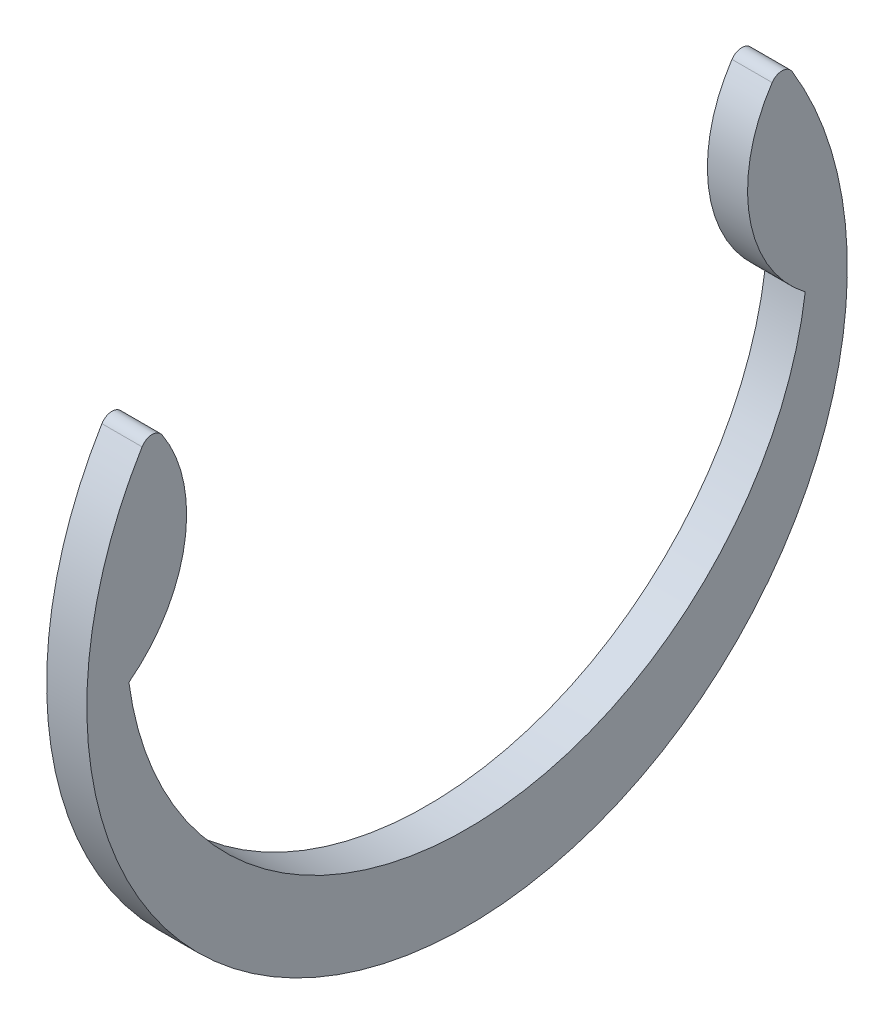
ISO-10303-21;
HEADER;
FILE_DESCRIPTION(('STEP AP214'),'2;1');
FILE_NAME('part.step','',(''),(''),'','','');
FILE_SCHEMA(('AUTOMOTIVE_DESIGN { 1 0 10303 214 1 1 1 1 }'));
ENDSEC;
DATA;
#1=APPLICATION_CONTEXT('core data for automotive mechanical design processes');
#2=APPLICATION_PROTOCOL_DEFINITION('international standard','automotive_design',2000,#1);
#3=PRODUCT_CONTEXT('',#1,'mechanical');
#4=PRODUCT('Part','Part','',(#3));
#5=PRODUCT_RELATED_PRODUCT_CATEGORY('part','',(#4));
#6=PRODUCT_DEFINITION_FORMATION('','',#4);
#7=PRODUCT_DEFINITION_CONTEXT('part definition',#1,'design');
#8=PRODUCT_DEFINITION('design','',#6,#7);
#9=PRODUCT_DEFINITION_SHAPE('','',#8);
#10=(LENGTH_UNIT() NAMED_UNIT(*) SI_UNIT(.MILLI.,.METRE.));
#11=(NAMED_UNIT(*) PLANE_ANGLE_UNIT() SI_UNIT($,.RADIAN.));
#12=(NAMED_UNIT(*) SI_UNIT($,.STERADIAN.) SOLID_ANGLE_UNIT());
#13=UNCERTAINTY_MEASURE_WITH_UNIT(LENGTH_MEASURE(1.E-05),#10,'distance_accuracy_value','');
#14=(GEOMETRIC_REPRESENTATION_CONTEXT(3) GLOBAL_UNCERTAINTY_ASSIGNED_CONTEXT((#13)) GLOBAL_UNIT_ASSIGNED_CONTEXT((#10,
#11,#12)) REPRESENTATION_CONTEXT('',''));
#15=CARTESIAN_POINT('',(0.,0.,0.));
#16=DIRECTION('',(0.,0.,1.));
#17=DIRECTION('',(1.,0.,0.));
#18=AXIS2_PLACEMENT_3D('',#15,#16,#17);
#19=CARTESIAN_POINT('',(-0.533399999999989,2.14558900946491,5.66841071299605));
#20=DIRECTION('',(-1.,0.,0.));
#21=DIRECTION('',(0.,-1.,0.));
#22=AXIS2_PLACEMENT_3D('',#19,#20,#21);
#23=PLANE('',#22);
#24=CARTESIAN_POINT('',(-0.533399999999989,0.,0.));
#25=DIRECTION('',(-1.,0.,0.));
#26=DIRECTION('',(0.,-1.,0.));
#27=AXIS2_PLACEMENT_3D('',#24,#25,#26);
#28=CIRCLE('',#27,10.0965);
#29=CARTESIAN_POINT('',(-0.533399999999989,5.24086666666668,8.62975253597823));
#30=VERTEX_POINT('',#29);
#31=CARTESIAN_POINT('',(-0.533400000000003,5.24086666666668,-8.62975253597823));
#32=VERTEX_POINT('',#31);
#33=EDGE_CURVE('E90',#30,#32,#28,.F.);
#34=ORIENTED_EDGE('',*,*,#33,.F.);
#35=CARTESIAN_POINT('',(-0.533399999999989,5.07785121071208,8.36132688543166));
#36=DIRECTION('',(-1.,0.,0.));
#37=DIRECTION('',(0.,-1.,0.));
#38=AXIS2_PLACEMENT_3D('',#35,#36,#37);
#39=CIRCLE('',#38,0.314048354161319);
#40=CARTESIAN_POINT('',(-0.533399999999989,5.25205704639286,8.10002496127839));
#41=VERTEX_POINT('',#40);
#42=EDGE_CURVE('E80',#41,#30,#39,.F.);
#43=ORIENTED_EDGE('',*,*,#42,.F.);
#44=CARTESIAN_POINT('',(-0.533399999999989,3.09413633880058,11.3368214259921));
#45=DIRECTION('',(-1.,0.,0.));
#46=DIRECTION('',(0.,-1.,0.));
#47=AXIS2_PLACEMENT_3D('',#44,#45,#46);
#48=CIRCLE('',#47,3.89017649139968);
#49=CARTESIAN_POINT('',(-0.533399999999989,0.,8.97890000000003));
#50=VERTEX_POINT('',#49);
#51=EDGE_CURVE('E75',#50,#41,#48,.F.);
#52=ORIENTED_EDGE('',*,*,#51,.F.);
#53=CARTESIAN_POINT('',(-0.533399999999989,1.19704168012925,0.));
#54=DIRECTION('',(-1.,0.,0.));
#55=DIRECTION('',(0.,-1.,0.));
#56=AXIS2_PLACEMENT_3D('',#53,#54,#55);
#57=CIRCLE('',#56,9.05834168012927);
#58=CARTESIAN_POINT('',(-0.533399999999996,0.,-8.97890000000002));
#59=VERTEX_POINT('',#58);
#60=EDGE_CURVE('E19',#50,#59,#57,.F.);
#61=ORIENTED_EDGE('',*,*,#60,.T.);
#62=CARTESIAN_POINT('',(-0.533400000000003,3.09413633880057,-11.3368214259921));
#63=DIRECTION('',(-1.,0.,0.));
#64=DIRECTION('',(0.,-1.,0.));
#65=AXIS2_PLACEMENT_3D('',#62,#63,#64);
#66=CIRCLE('',#65,3.89017649139968);
#67=CARTESIAN_POINT('',(-0.533400000000003,5.25205704639285,-8.10002496127839));
#68=VERTEX_POINT('',#67);
#69=EDGE_CURVE('E95',#68,#59,#66,.F.);
#70=ORIENTED_EDGE('',*,*,#69,.F.);
#71=CARTESIAN_POINT('',(-0.533400000000003,5.07785121071208,-8.36132688543166));
#72=DIRECTION('',(-1.,0.,0.));
#73=DIRECTION('',(0.,-1.,0.));
#74=AXIS2_PLACEMENT_3D('',#71,#72,#73);
#75=CIRCLE('',#74,0.314048354161319);
#76=EDGE_CURVE('E93',#32,#68,#75,.F.);
#77=ORIENTED_EDGE('',*,*,#76,.F.);
#78=EDGE_LOOP('',(#34,#43,#52,#61,#70,#77));
#79=FACE_BOUND('',#78,.T.);
#80=ADVANCED_FACE('F16',(#79),#23,.T.);
#81=CARTESIAN_POINT('',(0.533400000000004,1.19704168012925,0.));
#82=DIRECTION('',(-1.,0.,0.));
#83=DIRECTION('',(0.,-1.,0.));
#84=AXIS2_PLACEMENT_3D('',#81,#82,#83);
#85=CYLINDRICAL_SURFACE('',#84,9.05834168012927);
#86=DIRECTION('',(-1.,0.,0.));
#87=VECTOR('',#86,1.);
#88=CARTESIAN_POINT('',(0.533400000000003,0.,8.97890000000003));
#89=LINE('',#88,#87);
#90=CARTESIAN_POINT('',(0.533400000000003,0.,8.97890000000003));
#91=VERTEX_POINT('',#90);
#92=EDGE_CURVE('E69',#91,#50,#89,.T.);
#93=ORIENTED_EDGE('',*,*,#92,.F.);
#94=CARTESIAN_POINT('',(0.533400000000003,1.19704168012925,0.));
#95=DIRECTION('',(-1.,0.,0.));
#96=DIRECTION('',(0.,-1.,0.));
#97=AXIS2_PLACEMENT_3D('',#94,#95,#96);
#98=CIRCLE('',#97,9.05834168012927);
#99=CARTESIAN_POINT('',(0.533400000000003,0.,-8.97890000000003));
#100=VERTEX_POINT('',#99);
#101=EDGE_CURVE('E77',#91,#100,#98,.F.);
#102=ORIENTED_EDGE('',*,*,#101,.T.);
#103=DIRECTION('',(-1.,0.,0.));
#104=VECTOR('',#103,1.);
#105=CARTESIAN_POINT('',(0.533400000000004,0.,-8.97890000000002));
#106=LINE('',#105,#104);
#107=EDGE_CURVE('E70',#59,#100,#106,.F.);
#108=ORIENTED_EDGE('',*,*,#107,.F.);
#109=ORIENTED_EDGE('',*,*,#60,.F.);
#110=EDGE_LOOP('',(#93,#102,#108,#109));
#111=FACE_BOUND('',#110,.T.);
#112=ADVANCED_FACE('F67',(#111),#85,.F.);
#113=CARTESIAN_POINT('',(0.533400000000004,3.09413633880057,-11.3368214259921));
#114=DIRECTION('',(-1.,0.,0.));
#115=DIRECTION('',(0.,-1.,0.));
#116=AXIS2_PLACEMENT_3D('',#113,#114,#115);
#117=CYLINDRICAL_SURFACE('',#116,3.89017649139968);
#118=DIRECTION('',(-1.,0.,0.));
#119=VECTOR('',#118,1.);
#120=CARTESIAN_POINT('',(0.533400000000004,5.25205704639285,-8.10002496127839));
#121=LINE('',#120,#119);
#122=CARTESIAN_POINT('',(0.533400000000003,5.25205704639285,-8.10002496127839));
#123=VERTEX_POINT('',#122);
#124=EDGE_CURVE('E94',#68,#123,#121,.F.);
#125=ORIENTED_EDGE('',*,*,#124,.F.);
#126=ORIENTED_EDGE('',*,*,#69,.T.);
#127=ORIENTED_EDGE('',*,*,#107,.T.);
#128=CARTESIAN_POINT('',(0.533400000000003,3.09413633880057,-11.3368214259921));
#129=DIRECTION('',(-1.,0.,0.));
#130=DIRECTION('',(0.,-1.,0.));
#131=AXIS2_PLACEMENT_3D('',#128,#129,#130);
#132=CIRCLE('',#131,3.89017649139968);
#133=EDGE_CURVE('E110',#100,#123,#132,.T.);
#134=ORIENTED_EDGE('',*,*,#133,.T.);
#135=EDGE_LOOP('',(#125,#126,#127,#134));
#136=FACE_BOUND('',#135,.T.);
#137=ADVANCED_FACE('F167',(#136),#117,.T.);
#138=CARTESIAN_POINT('',(0.533400000000004,5.07785121071208,-8.36132688543166));
#139=DIRECTION('',(-1.,0.,0.));
#140=DIRECTION('',(0.,-1.,0.));
#141=AXIS2_PLACEMENT_3D('',#138,#139,#140);
#142=CYLINDRICAL_SURFACE('',#141,0.314048354161319);
#143=CARTESIAN_POINT('',(0.533400000000003,5.07785121071208,-8.36132688543166));
#144=DIRECTION('',(-1.,0.,0.));
#145=DIRECTION('',(0.,-1.,0.));
#146=AXIS2_PLACEMENT_3D('',#143,#144,#145);
#147=CIRCLE('',#146,0.314048354161319);
#148=CARTESIAN_POINT('',(0.533400000000003,5.24086666666668,-8.62975253597823));
#149=VERTEX_POINT('',#148);
#150=EDGE_CURVE('E108',#123,#149,#147,.T.);
#151=ORIENTED_EDGE('',*,*,#150,.T.);
#152=DIRECTION('',(-1.,0.,0.));
#153=VECTOR('',#152,1.);
#154=CARTESIAN_POINT('',(0.533400000000003,5.24086666666668,-8.62975253597823));
#155=LINE('',#154,#153);
#156=EDGE_CURVE('E92',#32,#149,#155,.F.);
#157=ORIENTED_EDGE('',*,*,#156,.F.);
#158=ORIENTED_EDGE('',*,*,#76,.T.);
#159=ORIENTED_EDGE('',*,*,#124,.T.);
#160=EDGE_LOOP('',(#151,#157,#158,#159));
#161=FACE_BOUND('',#160,.T.);
#162=ADVANCED_FACE('F119',(#161),#142,.T.);
#163=CARTESIAN_POINT('',(0.533400000000003,0.,0.));
#164=DIRECTION('',(-1.,0.,0.));
#165=DIRECTION('',(0.,-1.,0.));
#166=AXIS2_PLACEMENT_3D('',#163,#164,#165);
#167=CYLINDRICAL_SURFACE('',#166,10.0965);
#168=DIRECTION('',(-1.,0.,0.));
#169=VECTOR('',#168,1.);
#170=CARTESIAN_POINT('',(0.533400000000003,5.24086666666668,8.62975253597823));
#171=LINE('',#170,#169);
#172=CARTESIAN_POINT('',(0.533400000000003,5.24086666666668,8.62975253597823));
#173=VERTEX_POINT('',#172);
#174=EDGE_CURVE('E81',#30,#173,#171,.F.);
#175=ORIENTED_EDGE('',*,*,#174,.F.);
#176=ORIENTED_EDGE('',*,*,#33,.T.);
#177=ORIENTED_EDGE('',*,*,#156,.T.);
#178=CARTESIAN_POINT('',(0.533400000000004,0.,0.));
#179=DIRECTION('',(-1.,0.,0.));
#180=DIRECTION('',(0.,-1.,0.));
#181=AXIS2_PLACEMENT_3D('',#178,#179,#180);
#182=CIRCLE('',#181,10.0965);
#183=EDGE_CURVE('E106',#149,#173,#182,.T.);
#184=ORIENTED_EDGE('',*,*,#183,.T.);
#185=EDGE_LOOP('',(#175,#176,#177,#184));
#186=FACE_BOUND('',#185,.T.);
#187=ADVANCED_FACE('F123',(#186),#167,.T.);
#188=CARTESIAN_POINT('',(0.533400000000003,5.07785121071208,8.36132688543166));
#189=DIRECTION('',(-1.,0.,0.));
#190=DIRECTION('',(0.,-1.,0.));
#191=AXIS2_PLACEMENT_3D('',#188,#189,#190);
#192=CYLINDRICAL_SURFACE('',#191,0.314048354161319);
#193=CARTESIAN_POINT('',(0.533400000000003,5.07785121071208,8.36132688543166));
#194=DIRECTION('',(-1.,0.,0.));
#195=DIRECTION('',(0.,-1.,0.));
#196=AXIS2_PLACEMENT_3D('',#193,#194,#195);
#197=CIRCLE('',#196,0.314048354161319);
#198=CARTESIAN_POINT('',(0.533400000000003,5.25205704639286,8.10002496127839));
#199=VERTEX_POINT('',#198);
#200=EDGE_CURVE('E25',#173,#199,#197,.T.);
#201=ORIENTED_EDGE('',*,*,#200,.T.);
#202=DIRECTION('',(-1.,0.,0.));
#203=VECTOR('',#202,1.);
#204=CARTESIAN_POINT('',(0.533400000000003,5.25205704639286,8.10002496127839));
#205=LINE('',#204,#203);
#206=EDGE_CURVE('E33',#41,#199,#205,.F.);
#207=ORIENTED_EDGE('',*,*,#206,.F.);
#208=ORIENTED_EDGE('',*,*,#42,.T.);
#209=ORIENTED_EDGE('',*,*,#174,.T.);
#210=EDGE_LOOP('',(#201,#207,#208,#209));
#211=FACE_BOUND('',#210,.T.);
#212=ADVANCED_FACE('F125',(#211),#192,.T.);
#213=CARTESIAN_POINT('',(0.533400000000003,3.09413633880058,11.3368214259921));
#214=DIRECTION('',(-1.,0.,0.));
#215=DIRECTION('',(0.,-1.,0.));
#216=AXIS2_PLACEMENT_3D('',#213,#214,#215);
#217=CYLINDRICAL_SURFACE('',#216,3.89017649139968);
#218=CARTESIAN_POINT('',(0.533400000000003,3.09413633880058,11.3368214259921));
#219=DIRECTION('',(-1.,0.,0.));
#220=DIRECTION('',(0.,-1.,0.));
#221=AXIS2_PLACEMENT_3D('',#218,#219,#220);
#222=CIRCLE('',#221,3.89017649139968);
#223=EDGE_CURVE('E11',#199,#91,#222,.T.);
#224=ORIENTED_EDGE('',*,*,#223,.T.);
#225=ORIENTED_EDGE('',*,*,#92,.T.);
#226=ORIENTED_EDGE('',*,*,#51,.T.);
#227=ORIENTED_EDGE('',*,*,#206,.T.);
#228=EDGE_LOOP('',(#224,#225,#226,#227));
#229=FACE_BOUND('',#228,.T.);
#230=ADVANCED_FACE('F74',(#229),#217,.T.);
#231=CARTESIAN_POINT('',(0.533400000000003,2.14558900946491,5.66841071299605));
#232=DIRECTION('',(-1.,0.,0.));
#233=DIRECTION('',(0.,-1.,0.));
#234=AXIS2_PLACEMENT_3D('',#231,#232,#233);
#235=PLANE('',#234);
#236=ORIENTED_EDGE('',*,*,#200,.F.);
#237=ORIENTED_EDGE('',*,*,#183,.F.);
#238=ORIENTED_EDGE('',*,*,#150,.F.);
#239=ORIENTED_EDGE('',*,*,#133,.F.);
#240=ORIENTED_EDGE('',*,*,#101,.F.);
#241=ORIENTED_EDGE('',*,*,#223,.F.);
#242=EDGE_LOOP('',(#236,#237,#238,#239,#240,#241));
#243=FACE_BOUND('',#242,.T.);
#244=ADVANCED_FACE('F114',(#243),#235,.F.);
#245=CLOSED_SHELL('',(#80,#112,#137,#162,#187,#212,#230,#244));
#246=MANIFOLD_SOLID_BREP('B1',#245);
#247=ADVANCED_BREP_SHAPE_REPRESENTATION('',(#18,#246),#14);
#248=SHAPE_DEFINITION_REPRESENTATION(#9,#247);
ENDSEC;
END-ISO-10303-21;
